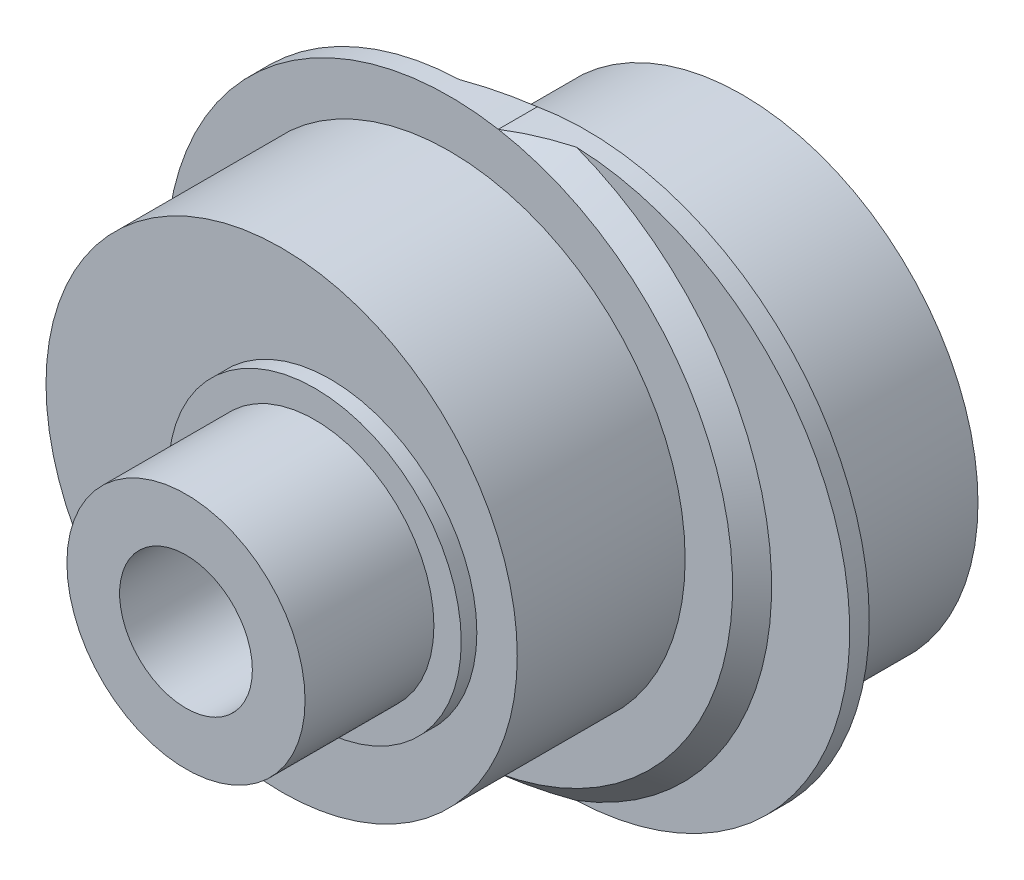
ISO-10303-21;
HEADER;
FILE_DESCRIPTION(('STEP AP214'),'2;1');
FILE_NAME('part.step','',(''),(''),'','','');
FILE_SCHEMA(('AUTOMOTIVE_DESIGN { 1 0 10303 214 1 1 1 1 }'));
ENDSEC;
DATA;
#1=APPLICATION_CONTEXT('core data for automotive mechanical design processes');
#2=APPLICATION_PROTOCOL_DEFINITION('international standard','automotive_design',2000,#1);
#3=PRODUCT_CONTEXT('',#1,'mechanical');
#4=PRODUCT('Part','Part','',(#3));
#5=PRODUCT_RELATED_PRODUCT_CATEGORY('part','',(#4));
#6=PRODUCT_DEFINITION_FORMATION('','',#4);
#7=PRODUCT_DEFINITION_CONTEXT('part definition',#1,'design');
#8=PRODUCT_DEFINITION('design','',#6,#7);
#9=PRODUCT_DEFINITION_SHAPE('','',#8);
#10=(LENGTH_UNIT() NAMED_UNIT(*) SI_UNIT(.MILLI.,.METRE.));
#11=(NAMED_UNIT(*) PLANE_ANGLE_UNIT() SI_UNIT($,.RADIAN.));
#12=(NAMED_UNIT(*) SI_UNIT($,.STERADIAN.) SOLID_ANGLE_UNIT());
#13=UNCERTAINTY_MEASURE_WITH_UNIT(LENGTH_MEASURE(1.E-05),#10,'distance_accuracy_value','');
#14=(GEOMETRIC_REPRESENTATION_CONTEXT(3) GLOBAL_UNCERTAINTY_ASSIGNED_CONTEXT((#13)) GLOBAL_UNIT_ASSIGNED_CONTEXT((#10,
#11,#12)) REPRESENTATION_CONTEXT('',''));
#15=CARTESIAN_POINT('',(0.,0.,0.));
#16=DIRECTION('',(0.,0.,1.));
#17=DIRECTION('',(1.,0.,0.));
#18=AXIS2_PLACEMENT_3D('',#15,#16,#17);
#19=CARTESIAN_POINT('',(1.25,0.,0.));
#20=DIRECTION('',(0.,0.,-1.));
#21=DIRECTION('',(-1.,0.,0.));
#22=AXIS2_PLACEMENT_3D('',#19,#20,#21);
#23=PLANE('',#22);
#24=CARTESIAN_POINT('',(2.55,-2.55,0.));
#25=DIRECTION('',(0.,0.,-1.));
#26=DIRECTION('',(1.,0.,0.));
#27=AXIS2_PLACEMENT_3D('',#24,#25,#26);
#28=CIRCLE('',#27,0.5);
#29=CARTESIAN_POINT('',(3.05,-2.55,0.));
#30=VERTEX_POINT('',#29);
#31=CARTESIAN_POINT('',(2.55,-3.05,0.));
#32=VERTEX_POINT('',#31);
#33=EDGE_CURVE('E67',#30,#32,#28,.T.);
#34=ORIENTED_EDGE('',*,*,#33,.F.);
#35=DIRECTION('',(0.,-1.,0.));
#36=VECTOR('',#35,1.);
#37=CARTESIAN_POINT('',(3.05,2.55,0.));
#38=LINE('',#37,#36);
#39=CARTESIAN_POINT('',(3.05,2.55,0.));
#40=VERTEX_POINT('',#39);
#41=EDGE_CURVE('E166',#40,#30,#38,.T.);
#42=ORIENTED_EDGE('',*,*,#41,.F.);
#43=CARTESIAN_POINT('',(2.55,2.55,0.));
#44=DIRECTION('',(0.,0.,-1.));
#45=DIRECTION('',(1.,0.,0.));
#46=AXIS2_PLACEMENT_3D('',#43,#44,#45);
#47=CIRCLE('',#46,0.5);
#48=CARTESIAN_POINT('',(2.55,3.05,0.));
#49=VERTEX_POINT('',#48);
#50=EDGE_CURVE('E170',#49,#40,#47,.T.);
#51=ORIENTED_EDGE('',*,*,#50,.F.);
#52=DIRECTION('',(1.,0.,0.));
#53=VECTOR('',#52,1.);
#54=CARTESIAN_POINT('',(2.55,3.05,0.));
#55=LINE('',#54,#53);
#56=CARTESIAN_POINT('',(-2.55,3.05,0.));
#57=VERTEX_POINT('',#56);
#58=EDGE_CURVE('E209',#57,#49,#55,.T.);
#59=ORIENTED_EDGE('',*,*,#58,.F.);
#60=CARTESIAN_POINT('',(-2.55,2.55,0.));
#61=DIRECTION('',(0.,0.,-1.));
#62=DIRECTION('',(-1.,0.,0.));
#63=AXIS2_PLACEMENT_3D('',#60,#61,#62);
#64=CIRCLE('',#63,0.5);
#65=CARTESIAN_POINT('',(-3.05,2.55,0.));
#66=VERTEX_POINT('',#65);
#67=EDGE_CURVE('E205',#66,#57,#64,.T.);
#68=ORIENTED_EDGE('',*,*,#67,.F.);
#69=DIRECTION('',(0.,1.,0.));
#70=VECTOR('',#69,1.);
#71=CARTESIAN_POINT('',(-3.05,2.55,0.));
#72=LINE('',#71,#70);
#73=CARTESIAN_POINT('',(-3.05,-2.55,0.));
#74=VERTEX_POINT('',#73);
#75=EDGE_CURVE('E201',#74,#66,#72,.T.);
#76=ORIENTED_EDGE('',*,*,#75,.F.);
#77=CARTESIAN_POINT('',(-2.55,-2.55,0.));
#78=DIRECTION('',(0.,0.,-1.));
#79=DIRECTION('',(-1.,0.,0.));
#80=AXIS2_PLACEMENT_3D('',#77,#78,#79);
#81=CIRCLE('',#80,0.5);
#82=CARTESIAN_POINT('',(-2.55,-3.05,0.));
#83=VERTEX_POINT('',#82);
#84=EDGE_CURVE('E197',#83,#74,#81,.T.);
#85=ORIENTED_EDGE('',*,*,#84,.F.);
#86=DIRECTION('',(-1.,0.,0.));
#87=VECTOR('',#86,1.);
#88=CARTESIAN_POINT('',(2.55,-3.05,0.));
#89=LINE('',#88,#87);
#90=EDGE_CURVE('E194',#32,#83,#89,.T.);
#91=ORIENTED_EDGE('',*,*,#90,.F.);
#92=EDGE_LOOP('',(#34,#42,#51,#59,#68,#76,#85,#91));
#93=FACE_BOUND('',#92,.T.);
#94=CARTESIAN_POINT('',(1.25,0.,0.));
#95=DIRECTION('',(0.,0.,-1.));
#96=DIRECTION('',(-1.,0.,0.));
#97=AXIS2_PLACEMENT_3D('',#94,#95,#96);
#98=CIRCLE('',#97,6.035);
#99=CARTESIAN_POINT('',(-4.785,0.,0.));
#100=VERTEX_POINT('',#99);
#101=EDGE_CURVE('E252',#100,#100,#98,.T.);
#102=ORIENTED_EDGE('',*,*,#101,.T.);
#103=EDGE_LOOP('',(#102));
#104=FACE_BOUND('',#103,.T.);
#105=ADVANCED_FACE('F50',(#93,#104),#23,.T.);
#106=CARTESIAN_POINT('',(0.,0.,5.));
#107=DIRECTION('',(0.,0.,1.));
#108=DIRECTION('',(1.,0.,0.));
#109=AXIS2_PLACEMENT_3D('',#106,#107,#108);
#110=PLANE('',#109);
#111=CARTESIAN_POINT('',(-1.25,0.,5.));
#112=DIRECTION('',(0.,0.,1.));
#113=DIRECTION('',(1.,0.,0.));
#114=AXIS2_PLACEMENT_3D('',#111,#112,#113);
#115=CIRCLE('',#114,6.035);
#116=CARTESIAN_POINT('',(4.785,0.,5.));
#117=VERTEX_POINT('',#116);
#118=EDGE_CURVE('E256',#117,#117,#115,.T.);
#119=ORIENTED_EDGE('',*,*,#118,.F.);
#120=EDGE_LOOP('',(#119));
#121=FACE_BOUND('',#120,.T.);
#122=CARTESIAN_POINT('',(-1.25,0.,5.));
#123=DIRECTION('',(0.,0.,1.));
#124=DIRECTION('',(1.,0.,0.));
#125=AXIS2_PLACEMENT_3D('',#122,#123,#124);
#126=CIRCLE('',#125,7.25);
#127=CARTESIAN_POINT('',(0.,-7.14142842854285,5.));
#128=VERTEX_POINT('',#127);
#129=CARTESIAN_POINT('',(0.,7.14142842854285,5.));
#130=VERTEX_POINT('',#129);
#131=EDGE_CURVE('E74',#128,#130,#126,.F.);
#132=ORIENTED_EDGE('',*,*,#131,.F.);
#133=EDGE_CURVE('E476',#130,#128,#126,.F.);
#134=ORIENTED_EDGE('',*,*,#133,.F.);
#135=EDGE_LOOP('',(#132,#134));
#136=FACE_BOUND('',#135,.T.);
#137=ADVANCED_FACE('F52',(#121,#136),#110,.T.);
#138=CARTESIAN_POINT('',(1.25,0.,5.002));
#139=DIRECTION('',(0.,0.,-1.));
#140=DIRECTION('',(-1.,0.,0.));
#141=AXIS2_PLACEMENT_3D('',#138,#139,#140);
#142=CYLINDRICAL_SURFACE('',#141,7.25);
#143=DIRECTION('',(0.,0.,-1.));
#144=VECTOR('',#143,1.);
#145=CARTESIAN_POINT('',(0.,-7.14142842854286,4.5));
#146=LINE('',#145,#144);
#147=CARTESIAN_POINT('',(0.,-7.14142842854285,4.));
#148=VERTEX_POINT('',#147);
#149=EDGE_CURVE('E403',#148,#128,#146,.F.);
#150=ORIENTED_EDGE('',*,*,#149,.F.);
#151=CARTESIAN_POINT('',(1.25,0.,4.));
#152=DIRECTION('',(0.,0.,1.));
#153=DIRECTION('',(1.,0.,0.));
#154=AXIS2_PLACEMENT_3D('',#151,#152,#153);
#155=CIRCLE('',#154,7.25);
#156=CARTESIAN_POINT('',(0.,7.14142842854285,4.));
#157=VERTEX_POINT('',#156);
#158=EDGE_CURVE('E401',#148,#157,#155,.T.);
#159=ORIENTED_EDGE('',*,*,#158,.T.);
#160=DIRECTION('',(0.,0.,-1.));
#161=VECTOR('',#160,1.);
#162=CARTESIAN_POINT('',(0.,7.14142842854285,5.));
#163=LINE('',#162,#161);
#164=EDGE_CURVE('E402',#130,#157,#163,.T.);
#165=ORIENTED_EDGE('',*,*,#164,.F.);
#166=CARTESIAN_POINT('',(0.,7.14142842854285,5.));
#167=CARTESIAN_POINT('',(0.123509212670828,7.16304891105433,4.95740968363325));
#168=CARTESIAN_POINT('',(0.247635722677284,7.18147105171403,4.91498366677334));
#169=CARTESIAN_POINT('',(0.49651091045968,7.21182527272824,4.83064523991889));
#170=CARTESIAN_POINT('',(0.621257332919159,7.22377306991179,4.78873182975381));
#171=CARTESIAN_POINT('',(0.871367149572558,7.24119131188943,4.7053944927514));
#172=CARTESIAN_POINT('',(0.996730552877659,7.24666166073876,4.66397057317345));
#173=CARTESIAN_POINT('',(1.24806465393637,7.25109232554975,4.58158902108588));
#174=CARTESIAN_POINT('',(1.37403608710189,7.25003669470633,4.54063277598186));
#175=CARTESIAN_POINT('',(1.5,7.24568837309472,4.5));
#176=B_SPLINE_CURVE_WITH_KNOTS('',3,(#166,#167,#168,#169,#170,#171,#172,#173,#174,#175),
.UNSPECIFIED.,.F.,.F.,(4,2,2,2,4),(0.,0.397230594114684,0.793492519067464,1.18976031342777,
1.58699680509372),.UNSPECIFIED.);
#177=CARTESIAN_POINT('',(1.5,7.24568837309472,4.5));
#178=VERTEX_POINT('',#177);
#179=EDGE_CURVE('E313',#130,#178,#176,.T.);
#180=ORIENTED_EDGE('',*,*,#179,.T.);
#181=CARTESIAN_POINT('',(1.25,0.,4.5));
#182=DIRECTION('',(0.,0.,1.));
#183=DIRECTION('',(1.,0.,0.));
#184=AXIS2_PLACEMENT_3D('',#181,#182,#183);
#185=CIRCLE('',#184,7.25);
#186=CARTESIAN_POINT('',(1.5,-7.24568837309472,4.5));
#187=VERTEX_POINT('',#186);
#188=EDGE_CURVE('E328',#187,#178,#185,.T.);
#189=ORIENTED_EDGE('',*,*,#188,.F.);
#190=CARTESIAN_POINT('',(1.5,-7.24568837309472,4.5));
#191=CARTESIAN_POINT('',(1.37403608710189,-7.25003669470633,4.54063277598186));
#192=CARTESIAN_POINT('',(1.24806465393637,-7.25109232554975,4.58158902108588));
#193=CARTESIAN_POINT('',(0.996730552877659,-7.24666166073876,4.66397057317345));
#194=CARTESIAN_POINT('',(0.871367149572559,-7.24119131188943,4.7053944927514));
#195=CARTESIAN_POINT('',(0.621257332919159,-7.22377306991179,4.78873182975381));
#196=CARTESIAN_POINT('',(0.49651091045968,-7.21182527272824,4.83064523991889));
#197=CARTESIAN_POINT('',(0.247635722677285,-7.18147105171403,4.91498366677334));
#198=CARTESIAN_POINT('',(0.123509212670829,-7.16304891105433,4.95740968363325));
#199=CARTESIAN_POINT('',(0.,-7.14142842854285,5.));
#200=B_SPLINE_CURVE_WITH_KNOTS('',3,(#190,#191,#192,#193,#194,#195,#196,#197,#198,#199),
.UNSPECIFIED.,.F.,.F.,(4,2,2,2,4),(0.,0.397236491665957,0.793504286026259,1.18976621097904,
1.58699680509372),.UNSPECIFIED.);
#201=EDGE_CURVE('E322',#187,#128,#200,.T.);
#202=ORIENTED_EDGE('',*,*,#201,.T.);
#203=EDGE_LOOP('',(#150,#159,#165,#180,#189,#202));
#204=FACE_BOUND('',#203,.T.);
#205=ADVANCED_FACE('F303',(#204),#142,.T.);
#206=CARTESIAN_POINT('',(0.,0.,4.));
#207=DIRECTION('',(0.,0.,1.));
#208=DIRECTION('',(1.,0.,0.));
#209=AXIS2_PLACEMENT_3D('',#206,#207,#208);
#210=PLANE('',#209);
#211=CARTESIAN_POINT('',(1.25,0.,4.));
#212=DIRECTION('',(0.,0.,1.));
#213=DIRECTION('',(1.,0.,0.));
#214=AXIS2_PLACEMENT_3D('',#211,#212,#213);
#215=CIRCLE('',#214,6.035);
#216=CARTESIAN_POINT('',(7.285,0.,4.));
#217=VERTEX_POINT('',#216);
#218=EDGE_CURVE('E60',#217,#217,#215,.F.);
#219=ORIENTED_EDGE('',*,*,#218,.F.);
#220=EDGE_LOOP('',(#219));
#221=FACE_BOUND('',#220,.T.);
#222=EDGE_CURVE('E329',#157,#148,#155,.T.);
#223=ORIENTED_EDGE('',*,*,#222,.F.);
#224=ORIENTED_EDGE('',*,*,#158,.F.);
#225=EDGE_LOOP('',(#223,#224));
#226=FACE_BOUND('',#225,.T.);
#227=ADVANCED_FACE('F298',(#221,#226),#210,.F.);
#228=CARTESIAN_POINT('',(-1.25,0.,5.002));
#229=DIRECTION('',(0.,0.,-1.));
#230=DIRECTION('',(-1.,0.,0.));
#231=AXIS2_PLACEMENT_3D('',#228,#229,#230);
#232=CYLINDRICAL_SURFACE('',#231,7.25);
#233=CARTESIAN_POINT('',(-1.25,0.,4.5));
#234=DIRECTION('',(0.,0.,-1.));
#235=DIRECTION('',(1.,0.,0.));
#236=AXIS2_PLACEMENT_3D('',#233,#234,#235);
#237=CIRCLE('',#236,7.25);
#238=CARTESIAN_POINT('',(-1.49999999999996,-7.24568837309473,4.5));
#239=VERTEX_POINT('',#238);
#240=CARTESIAN_POINT('',(-1.50000000000003,7.24568837309471,4.5));
#241=VERTEX_POINT('',#240);
#242=EDGE_CURVE('E330',#239,#241,#237,.T.);
#243=ORIENTED_EDGE('',*,*,#242,.F.);
#244=CARTESIAN_POINT('',(-1.49999999999996,-7.24568837309473,4.5));
#245=CARTESIAN_POINT('',(-1.37403608710186,-7.25003669470634,4.45936722401813));
#246=CARTESIAN_POINT('',(-1.24806465393634,-7.25109232554975,4.41841097891411));
#247=CARTESIAN_POINT('',(-0.996730552877636,-7.24666166073876,4.33602942682654));
#248=CARTESIAN_POINT('',(-0.871367149572538,-7.24119131188943,4.2946055072486));
#249=CARTESIAN_POINT('',(-0.621257332919143,-7.22377306991179,4.21126817024618));
#250=CARTESIAN_POINT('',(-0.496510910459668,-7.21182527272824,4.1693547600811));
#251=CARTESIAN_POINT('',(-0.247635722677277,-7.18147105171403,4.08501633322665));
#252=CARTESIAN_POINT('',(-0.123509212670824,-7.16304891105433,4.04259031636675));
#253=CARTESIAN_POINT('',(0.,-7.14142842854285,4.));
#254=B_SPLINE_CURVE_WITH_KNOTS('',3,(#244,#245,#246,#247,#248,#249,#250,#251,#252,#253),
.UNSPECIFIED.,.F.,.F.,(4,2,2,2,4),(0.,0.397236491665947,0.793504286026242,1.18976621097901,
1.58699680509369),.UNSPECIFIED.);
#255=EDGE_CURVE('E282',#239,#148,#254,.T.);
#256=ORIENTED_EDGE('',*,*,#255,.T.);
#257=ORIENTED_EDGE('',*,*,#149,.T.);
#258=ORIENTED_EDGE('',*,*,#131,.T.);
#259=ORIENTED_EDGE('',*,*,#164,.T.);
#260=CARTESIAN_POINT('',(0.,7.14142842854285,4.));
#261=CARTESIAN_POINT('',(-0.123509212670831,7.16304891105433,4.04259031636675));
#262=CARTESIAN_POINT('',(-0.24763572267729,7.18147105171404,4.08501633322666));
#263=CARTESIAN_POINT('',(-0.49651091045969,7.21182527272825,4.16935476008111));
#264=CARTESIAN_POINT('',(-0.62125733291917,7.22377306991179,4.21126817024619));
#265=CARTESIAN_POINT('',(-0.871367149572574,7.24119131188943,4.29460550724861));
#266=CARTESIAN_POINT('',(-0.996730552877677,7.24666166073876,4.33602942682656));
#267=CARTESIAN_POINT('',(-1.24806465393639,7.25109232554975,4.41841097891412));
#268=CARTESIAN_POINT('',(-1.37403608710192,7.25003669470633,4.45936722401814));
#269=CARTESIAN_POINT('',(-1.50000000000003,7.24568837309472,4.5));
#270=B_SPLINE_CURVE_WITH_KNOTS('',3,(#260,#261,#262,#263,#264,#265,#266,#267,#268,#269),
.UNSPECIFIED.,.F.,.F.,(4,2,2,2,4),(0.,0.397230594114692,0.793492519067479,1.18976031342779,
1.58699680509375),.UNSPECIFIED.);
#271=EDGE_CURVE('E272',#157,#241,#270,.T.);
#272=ORIENTED_EDGE('',*,*,#271,.T.);
#273=EDGE_LOOP('',(#243,#256,#257,#258,#259,#272));
#274=FACE_BOUND('',#273,.T.);
#275=ADVANCED_FACE('F293',(#274),#232,.T.);
#276=CARTESIAN_POINT('',(0.,0.,4.5));
#277=DIRECTION('',(0.,0.,1.));
#278=DIRECTION('',(1.,0.,0.));
#279=AXIS2_PLACEMENT_3D('',#276,#277,#278);
#280=PLANE('',#279);
#281=ORIENTED_EDGE('',*,*,#188,.T.);
#282=CARTESIAN_POINT('',(-1.25,0.,4.5));
#283=DIRECTION('',(0.,0.,1.));
#284=DIRECTION('',(1.,0.,0.));
#285=AXIS2_PLACEMENT_3D('',#282,#283,#284);
#286=CIRCLE('',#285,7.75);
#287=EDGE_CURVE('E268',#178,#187,#286,.F.);
#288=ORIENTED_EDGE('',*,*,#287,.T.);
#289=EDGE_LOOP('',(#281,#288));
#290=FACE_BOUND('',#289,.T.);
#291=ADVANCED_FACE('F297',(#290),#280,.T.);
#292=CARTESIAN_POINT('',(0.,0.,4.5));
#293=DIRECTION('',(0.,0.,1.));
#294=DIRECTION('',(1.,0.,0.));
#295=AXIS2_PLACEMENT_3D('',#292,#293,#294);
#296=PLANE('',#295);
#297=ORIENTED_EDGE('',*,*,#242,.T.);
#298=CARTESIAN_POINT('',(1.25,0.,4.5));
#299=DIRECTION('',(0.,0.,1.));
#300=DIRECTION('',(1.,0.,0.));
#301=AXIS2_PLACEMENT_3D('',#298,#299,#300);
#302=CIRCLE('',#301,7.75);
#303=EDGE_CURVE('E261',#241,#239,#302,.T.);
#304=ORIENTED_EDGE('',*,*,#303,.T.);
#305=EDGE_LOOP('',(#297,#304));
#306=FACE_BOUND('',#305,.T.);
#307=ADVANCED_FACE('F308',(#306),#296,.F.);
#308=CARTESIAN_POINT('',(-1.25,0.,4.5));
#309=DIRECTION('',(0.,0.,-1.));
#310=DIRECTION('',(-1.,0.,0.));
#311=AXIS2_PLACEMENT_3D('',#308,#309,#310);
#312=CONICAL_SURFACE('',#311,7.75,0.785398163397448);
#313=ORIENTED_EDGE('',*,*,#179,.F.);
#314=ORIENTED_EDGE('',*,*,#133,.T.);
#315=ORIENTED_EDGE('',*,*,#201,.F.);
#316=ORIENTED_EDGE('',*,*,#287,.F.);
#317=EDGE_LOOP('',(#313,#314,#315,#316));
#318=FACE_BOUND('',#317,.T.);
#319=ADVANCED_FACE('F305',(#318),#312,.T.);
#320=CARTESIAN_POINT('',(1.25,0.,4.5));
#321=DIRECTION('',(0.,0.,1.));
#322=DIRECTION('',(1.,0.,0.));
#323=AXIS2_PLACEMENT_3D('',#320,#321,#322);
#324=CONICAL_SURFACE('',#323,7.75,0.785398163397448);
#325=ORIENTED_EDGE('',*,*,#271,.F.);
#326=ORIENTED_EDGE('',*,*,#222,.T.);
#327=ORIENTED_EDGE('',*,*,#255,.F.);
#328=ORIENTED_EDGE('',*,*,#303,.F.);
#329=EDGE_LOOP('',(#325,#326,#327,#328));
#330=FACE_BOUND('',#329,.T.);
#331=ADVANCED_FACE('F290',(#330),#324,.T.);
#332=CARTESIAN_POINT('',(-1.25,0.,9.3));
#333=DIRECTION('',(0.,0.,-1.));
#334=DIRECTION('',(-1.,0.,0.));
#335=AXIS2_PLACEMENT_3D('',#332,#333,#334);
#336=CYLINDRICAL_SURFACE('',#335,6.035);
#337=CARTESIAN_POINT('',(-1.25,0.,9.3));
#338=DIRECTION('',(0.,0.,1.));
#339=DIRECTION('',(1.,0.,0.));
#340=AXIS2_PLACEMENT_3D('',#337,#338,#339);
#341=CIRCLE('',#340,6.035);
#342=CARTESIAN_POINT('',(4.785,0.,9.3));
#343=VERTEX_POINT('',#342);
#344=EDGE_CURVE('E257',#343,#343,#341,.T.);
#345=ORIENTED_EDGE('',*,*,#344,.F.);
#346=EDGE_LOOP('',(#345));
#347=FACE_BOUND('',#346,.T.);
#348=ORIENTED_EDGE('',*,*,#118,.T.);
#349=EDGE_LOOP('',(#348));
#350=FACE_BOUND('',#349,.T.);
#351=ADVANCED_FACE('F555',(#347,#350),#336,.T.);
#352=CARTESIAN_POINT('',(-1.25,0.,9.3));
#353=DIRECTION('',(0.,0.,1.));
#354=DIRECTION('',(1.,0.,0.));
#355=AXIS2_PLACEMENT_3D('',#352,#353,#354);
#356=PLANE('',#355);
#357=CARTESIAN_POINT('',(0.,0.,9.3));
#358=DIRECTION('',(0.,0.,1.));
#359=DIRECTION('',(1.,0.,0.));
#360=AXIS2_PLACEMENT_3D('',#357,#358,#359);
#361=CIRCLE('',#360,3.75);
#362=CARTESIAN_POINT('',(3.75,0.,9.3));
#363=VERTEX_POINT('',#362);
#364=EDGE_CURVE('E12',#363,#363,#361,.T.);
#365=ORIENTED_EDGE('',*,*,#364,.F.);
#366=EDGE_LOOP('',(#365));
#367=FACE_BOUND('',#366,.T.);
#368=ORIENTED_EDGE('',*,*,#344,.T.);
#369=EDGE_LOOP('',(#368));
#370=FACE_BOUND('',#369,.T.);
#371=ADVANCED_FACE('F551',(#367,#370),#356,.T.);
#372=CARTESIAN_POINT('',(1.25,0.,0.));
#373=DIRECTION('',(0.,0.,1.));
#374=DIRECTION('',(1.,0.,0.));
#375=AXIS2_PLACEMENT_3D('',#372,#373,#374);
#376=CYLINDRICAL_SURFACE('',#375,6.035);
#377=ORIENTED_EDGE('',*,*,#101,.F.);
#378=EDGE_LOOP('',(#377));
#379=FACE_BOUND('',#378,.T.);
#380=ORIENTED_EDGE('',*,*,#218,.T.);
#381=EDGE_LOOP('',(#380));
#382=FACE_BOUND('',#381,.T.);
#383=ADVANCED_FACE('F548',(#379,#382),#376,.T.);
#384=CARTESIAN_POINT('',(0.,0.,13.));
#385=DIRECTION('',(0.,0.,-1.));
#386=DIRECTION('',(-1.,0.,0.));
#387=AXIS2_PLACEMENT_3D('',#384,#385,#386);
#388=CYLINDRICAL_SURFACE('',#387,3.05);
#389=CARTESIAN_POINT('',(0.,0.,13.));
#390=DIRECTION('',(0.,0.,-1.));
#391=DIRECTION('',(-1.,0.,0.));
#392=AXIS2_PLACEMENT_3D('',#389,#390,#391);
#393=CIRCLE('',#392,3.05);
#394=CARTESIAN_POINT('',(-3.05,0.,13.));
#395=VERTEX_POINT('',#394);
#396=EDGE_CURVE('E248',#395,#395,#393,.T.);
#397=ORIENTED_EDGE('',*,*,#396,.T.);
#398=EDGE_LOOP('',(#397));
#399=FACE_BOUND('',#398,.T.);
#400=CARTESIAN_POINT('',(0.,0.,9.7));
#401=DIRECTION('',(0.,0.,-1.));
#402=DIRECTION('',(-1.,0.,0.));
#403=AXIS2_PLACEMENT_3D('',#400,#401,#402);
#404=CIRCLE('',#403,3.05);
#405=CARTESIAN_POINT('',(-3.05,0.,9.7));
#406=VERTEX_POINT('',#405);
#407=EDGE_CURVE('E240',#406,#406,#404,.T.);
#408=ORIENTED_EDGE('',*,*,#407,.F.);
#409=EDGE_LOOP('',(#408));
#410=FACE_BOUND('',#409,.T.);
#411=ADVANCED_FACE('F546',(#399,#410),#388,.T.);
#412=CARTESIAN_POINT('',(3.05,0.,13.));
#413=DIRECTION('',(0.,0.,1.));
#414=DIRECTION('',(1.,0.,0.));
#415=AXIS2_PLACEMENT_3D('',#412,#413,#414);
#416=PLANE('',#415);
#417=CARTESIAN_POINT('',(0.,0.,13.));
#418=DIRECTION('',(0.,0.,1.));
#419=DIRECTION('',(1.,0.,0.));
#420=AXIS2_PLACEMENT_3D('',#417,#418,#419);
#421=CIRCLE('',#420,1.69999999999999);
#422=CARTESIAN_POINT('',(1.69999999999999,0.,13.));
#423=VERTEX_POINT('',#422);
#424=EDGE_CURVE('E236',#423,#423,#421,.T.);
#425=ORIENTED_EDGE('',*,*,#424,.F.);
#426=EDGE_LOOP('',(#425));
#427=FACE_BOUND('',#426,.T.);
#428=ORIENTED_EDGE('',*,*,#396,.F.);
#429=EDGE_LOOP('',(#428));
#430=FACE_BOUND('',#429,.T.);
#431=ADVANCED_FACE('F601',(#427,#430),#416,.T.);
#432=CARTESIAN_POINT('',(0.,0.,13.));
#433=DIRECTION('',(0.,0.,-1.));
#434=DIRECTION('',(-1.,0.,0.));
#435=AXIS2_PLACEMENT_3D('',#432,#433,#434);
#436=CYLINDRICAL_SURFACE('',#435,3.75);
#437=ORIENTED_EDGE('',*,*,#364,.T.);
#438=EDGE_LOOP('',(#437));
#439=FACE_BOUND('',#438,.T.);
#440=CARTESIAN_POINT('',(0.,0.,9.7));
#441=DIRECTION('',(0.,0.,-1.));
#442=DIRECTION('',(-1.,0.,0.));
#443=AXIS2_PLACEMENT_3D('',#440,#441,#442);
#444=CIRCLE('',#443,3.75);
#445=CARTESIAN_POINT('',(-3.75,0.,9.7));
#446=VERTEX_POINT('',#445);
#447=EDGE_CURVE('E244',#446,#446,#444,.T.);
#448=ORIENTED_EDGE('',*,*,#447,.T.);
#449=EDGE_LOOP('',(#448));
#450=FACE_BOUND('',#449,.T.);
#451=ADVANCED_FACE('F609',(#439,#450),#436,.T.);
#452=CARTESIAN_POINT('',(3.75,0.,9.7));
#453=DIRECTION('',(0.,0.,1.));
#454=DIRECTION('',(1.,0.,0.));
#455=AXIS2_PLACEMENT_3D('',#452,#453,#454);
#456=PLANE('',#455);
#457=ORIENTED_EDGE('',*,*,#407,.T.);
#458=EDGE_LOOP('',(#457));
#459=FACE_BOUND('',#458,.T.);
#460=ORIENTED_EDGE('',*,*,#447,.F.);
#461=EDGE_LOOP('',(#460));
#462=FACE_BOUND('',#461,.T.);
#463=ADVANCED_FACE('F533',(#459,#462),#456,.T.);
#464=CARTESIAN_POINT('',(0.,0.,13.));
#465=DIRECTION('',(0.,0.,1.));
#466=DIRECTION('',(1.,0.,0.));
#467=AXIS2_PLACEMENT_3D('',#464,#465,#466);
#468=CYLINDRICAL_SURFACE('',#467,1.69999999999999);
#469=CARTESIAN_POINT('',(0.,0.,8.5));
#470=DIRECTION('',(0.,0.,1.));
#471=DIRECTION('',(1.,0.,0.));
#472=AXIS2_PLACEMENT_3D('',#469,#470,#471);
#473=CIRCLE('',#472,1.69999999999999);
#474=CARTESIAN_POINT('',(1.69999999999999,0.,8.5));
#475=VERTEX_POINT('',#474);
#476=EDGE_CURVE('E54',#475,#475,#473,.F.);
#477=ORIENTED_EDGE('',*,*,#476,.T.);
#478=EDGE_LOOP('',(#477));
#479=FACE_BOUND('',#478,.T.);
#480=ORIENTED_EDGE('',*,*,#424,.T.);
#481=EDGE_LOOP('',(#480));
#482=FACE_BOUND('',#481,.T.);
#483=ADVANCED_FACE('F523',(#479,#482),#468,.F.);
#484=CARTESIAN_POINT('',(2.55,-2.55,8.5));
#485=DIRECTION('',(0.,0.,1.));
#486=DIRECTION('',(1.,0.,0.));
#487=AXIS2_PLACEMENT_3D('',#484,#485,#486);
#488=PLANE('',#487);
#489=CARTESIAN_POINT('',(2.55,-2.55,8.5));
#490=DIRECTION('',(0.,0.,-1.));
#491=DIRECTION('',(1.,0.,0.));
#492=AXIS2_PLACEMENT_3D('',#489,#490,#491);
#493=CIRCLE('',#492,0.5);
#494=CARTESIAN_POINT('',(3.05,-2.55,8.5));
#495=VERTEX_POINT('',#494);
#496=CARTESIAN_POINT('',(2.55,-3.05,8.5));
#497=VERTEX_POINT('',#496);
#498=EDGE_CURVE('E143',#495,#497,#493,.T.);
#499=ORIENTED_EDGE('',*,*,#498,.T.);
#500=DIRECTION('',(-1.,0.,0.));
#501=VECTOR('',#500,1.);
#502=CARTESIAN_POINT('',(2.55,-3.05,8.5));
#503=LINE('',#502,#501);
#504=CARTESIAN_POINT('',(-2.55,-3.05,8.5));
#505=VERTEX_POINT('',#504);
#506=EDGE_CURVE('E153',#497,#505,#503,.T.);
#507=ORIENTED_EDGE('',*,*,#506,.T.);
#508=CARTESIAN_POINT('',(-2.55,-2.55,8.5));
#509=DIRECTION('',(0.,0.,-1.));
#510=DIRECTION('',(-1.,0.,0.));
#511=AXIS2_PLACEMENT_3D('',#508,#509,#510);
#512=CIRCLE('',#511,0.5);
#513=CARTESIAN_POINT('',(-3.05,-2.55,8.5));
#514=VERTEX_POINT('',#513);
#515=EDGE_CURVE('E159',#505,#514,#512,.T.);
#516=ORIENTED_EDGE('',*,*,#515,.T.);
#517=DIRECTION('',(0.,1.,0.));
#518=VECTOR('',#517,1.);
#519=CARTESIAN_POINT('',(-3.05,2.55,8.5));
#520=LINE('',#519,#518);
#521=CARTESIAN_POINT('',(-3.05,2.55,8.5));
#522=VERTEX_POINT('',#521);
#523=EDGE_CURVE('E175',#514,#522,#520,.T.);
#524=ORIENTED_EDGE('',*,*,#523,.T.);
#525=CARTESIAN_POINT('',(-2.55,2.55,8.5));
#526=DIRECTION('',(0.,0.,-1.));
#527=DIRECTION('',(-1.,0.,0.));
#528=AXIS2_PLACEMENT_3D('',#525,#526,#527);
#529=CIRCLE('',#528,0.5);
#530=CARTESIAN_POINT('',(-2.55,3.05,8.5));
#531=VERTEX_POINT('',#530);
#532=EDGE_CURVE('E179',#522,#531,#529,.T.);
#533=ORIENTED_EDGE('',*,*,#532,.T.);
#534=DIRECTION('',(1.,0.,0.));
#535=VECTOR('',#534,1.);
#536=CARTESIAN_POINT('',(2.55,3.05,8.5));
#537=LINE('',#536,#535);
#538=CARTESIAN_POINT('',(2.55,3.05,8.5));
#539=VERTEX_POINT('',#538);
#540=EDGE_CURVE('E183',#531,#539,#537,.T.);
#541=ORIENTED_EDGE('',*,*,#540,.T.);
#542=CARTESIAN_POINT('',(2.55,2.55,8.5));
#543=DIRECTION('',(0.,0.,-1.));
#544=DIRECTION('',(1.,0.,0.));
#545=AXIS2_PLACEMENT_3D('',#542,#543,#544);
#546=CIRCLE('',#545,0.5);
#547=CARTESIAN_POINT('',(3.05,2.55,8.5));
#548=VERTEX_POINT('',#547);
#549=EDGE_CURVE('E187',#539,#548,#546,.T.);
#550=ORIENTED_EDGE('',*,*,#549,.T.);
#551=DIRECTION('',(0.,-1.,0.));
#552=VECTOR('',#551,1.);
#553=CARTESIAN_POINT('',(3.05,2.55,8.5));
#554=LINE('',#553,#552);
#555=EDGE_CURVE('E150',#548,#495,#554,.T.);
#556=ORIENTED_EDGE('',*,*,#555,.T.);
#557=EDGE_LOOP('',(#499,#507,#516,#524,#533,#541,#550,#556));
#558=FACE_BOUND('',#557,.T.);
#559=ORIENTED_EDGE('',*,*,#476,.F.);
#560=EDGE_LOOP('',(#559));
#561=FACE_BOUND('',#560,.T.);
#562=ADVANCED_FACE('F161',(#558,#561),#488,.F.);
#563=CARTESIAN_POINT('',(2.55,-2.55,8.5));
#564=DIRECTION('',(0.,0.,-1.));
#565=DIRECTION('',(-1.,0.,0.));
#566=AXIS2_PLACEMENT_3D('',#563,#564,#565);
#567=CYLINDRICAL_SURFACE('',#566,0.5);
#568=ORIENTED_EDGE('',*,*,#33,.T.);
#569=DIRECTION('',(0.,0.,-1.));
#570=VECTOR('',#569,1.);
#571=CARTESIAN_POINT('',(2.55,-3.05,8.5));
#572=LINE('',#571,#570);
#573=EDGE_CURVE('E139',#497,#32,#572,.T.);
#574=ORIENTED_EDGE('',*,*,#573,.F.);
#575=ORIENTED_EDGE('',*,*,#498,.F.);
#576=DIRECTION('',(0.,0.,-1.));
#577=VECTOR('',#576,1.);
#578=CARTESIAN_POINT('',(3.05,-2.55,8.5));
#579=LINE('',#578,#577);
#580=EDGE_CURVE('E216',#495,#30,#579,.T.);
#581=ORIENTED_EDGE('',*,*,#580,.T.);
#582=EDGE_LOOP('',(#568,#574,#575,#581));
#583=FACE_BOUND('',#582,.T.);
#584=ADVANCED_FACE('F141',(#583),#567,.F.);
#585=CARTESIAN_POINT('',(3.05,2.55,8.5));
#586=DIRECTION('',(1.,0.,0.));
#587=DIRECTION('',(0.,1.,0.));
#588=AXIS2_PLACEMENT_3D('',#585,#586,#587);
#589=PLANE('',#588);
#590=ORIENTED_EDGE('',*,*,#41,.T.);
#591=ORIENTED_EDGE('',*,*,#580,.F.);
#592=ORIENTED_EDGE('',*,*,#555,.F.);
#593=DIRECTION('',(0.,0.,-1.));
#594=VECTOR('',#593,1.);
#595=CARTESIAN_POINT('',(3.05,2.55,8.5));
#596=LINE('',#595,#594);
#597=EDGE_CURVE('E219',#548,#40,#596,.T.);
#598=ORIENTED_EDGE('',*,*,#597,.T.);
#599=EDGE_LOOP('',(#590,#591,#592,#598));
#600=FACE_BOUND('',#599,.T.);
#601=ADVANCED_FACE('F531',(#600),#589,.F.);
#602=CARTESIAN_POINT('',(2.55,2.55,8.5));
#603=DIRECTION('',(0.,0.,-1.));
#604=DIRECTION('',(-1.,0.,0.));
#605=AXIS2_PLACEMENT_3D('',#602,#603,#604);
#606=CYLINDRICAL_SURFACE('',#605,0.5);
#607=ORIENTED_EDGE('',*,*,#50,.T.);
#608=ORIENTED_EDGE('',*,*,#597,.F.);
#609=ORIENTED_EDGE('',*,*,#549,.F.);
#610=DIRECTION('',(0.,0.,-1.));
#611=VECTOR('',#610,1.);
#612=CARTESIAN_POINT('',(2.55,3.05,8.5));
#613=LINE('',#612,#611);
#614=EDGE_CURVE('E222',#539,#49,#613,.T.);
#615=ORIENTED_EDGE('',*,*,#614,.T.);
#616=EDGE_LOOP('',(#607,#608,#609,#615));
#617=FACE_BOUND('',#616,.T.);
#618=ADVANCED_FACE('F652',(#617),#606,.F.);
#619=CARTESIAN_POINT('',(2.55,3.05,8.5));
#620=DIRECTION('',(0.,1.,0.));
#621=DIRECTION('',(0.,0.,1.));
#622=AXIS2_PLACEMENT_3D('',#619,#620,#621);
#623=PLANE('',#622);
#624=ORIENTED_EDGE('',*,*,#58,.T.);
#625=ORIENTED_EDGE('',*,*,#614,.F.);
#626=ORIENTED_EDGE('',*,*,#540,.F.);
#627=DIRECTION('',(0.,0.,-1.));
#628=VECTOR('',#627,1.);
#629=CARTESIAN_POINT('',(-2.55,3.05,8.5));
#630=LINE('',#629,#628);
#631=EDGE_CURVE('E225',#531,#57,#630,.T.);
#632=ORIENTED_EDGE('',*,*,#631,.T.);
#633=EDGE_LOOP('',(#624,#625,#626,#632));
#634=FACE_BOUND('',#633,.T.);
#635=ADVANCED_FACE('F662',(#634),#623,.F.);
#636=CARTESIAN_POINT('',(-2.55,2.55,8.5));
#637=DIRECTION('',(0.,0.,-1.));
#638=DIRECTION('',(-1.,0.,0.));
#639=AXIS2_PLACEMENT_3D('',#636,#637,#638);
#640=CYLINDRICAL_SURFACE('',#639,0.5);
#641=ORIENTED_EDGE('',*,*,#67,.T.);
#642=ORIENTED_EDGE('',*,*,#631,.F.);
#643=ORIENTED_EDGE('',*,*,#532,.F.);
#644=DIRECTION('',(0.,0.,-1.));
#645=VECTOR('',#644,1.);
#646=CARTESIAN_POINT('',(-3.05,2.55,8.5));
#647=LINE('',#646,#645);
#648=EDGE_CURVE('E228',#522,#66,#647,.T.);
#649=ORIENTED_EDGE('',*,*,#648,.T.);
#650=EDGE_LOOP('',(#641,#642,#643,#649));
#651=FACE_BOUND('',#650,.T.);
#652=ADVANCED_FACE('F673',(#651),#640,.F.);
#653=CARTESIAN_POINT('',(-3.05,2.55,8.5));
#654=DIRECTION('',(-1.,0.,0.));
#655=DIRECTION('',(0.,-1.,0.));
#656=AXIS2_PLACEMENT_3D('',#653,#654,#655);
#657=PLANE('',#656);
#658=ORIENTED_EDGE('',*,*,#75,.T.);
#659=ORIENTED_EDGE('',*,*,#648,.F.);
#660=ORIENTED_EDGE('',*,*,#523,.F.);
#661=DIRECTION('',(0.,0.,-1.));
#662=VECTOR('',#661,1.);
#663=CARTESIAN_POINT('',(-3.05,-2.55,8.5));
#664=LINE('',#663,#662);
#665=EDGE_CURVE('E231',#514,#74,#664,.T.);
#666=ORIENTED_EDGE('',*,*,#665,.T.);
#667=EDGE_LOOP('',(#658,#659,#660,#666));
#668=FACE_BOUND('',#667,.T.);
#669=ADVANCED_FACE('F684',(#668),#657,.F.);
#670=CARTESIAN_POINT('',(-2.55,-2.55,8.5));
#671=DIRECTION('',(0.,0.,-1.));
#672=DIRECTION('',(-1.,0.,0.));
#673=AXIS2_PLACEMENT_3D('',#670,#671,#672);
#674=CYLINDRICAL_SURFACE('',#673,0.5);
#675=ORIENTED_EDGE('',*,*,#84,.T.);
#676=ORIENTED_EDGE('',*,*,#665,.F.);
#677=ORIENTED_EDGE('',*,*,#515,.F.);
#678=DIRECTION('',(0.,0.,-1.));
#679=VECTOR('',#678,1.);
#680=CARTESIAN_POINT('',(-2.55,-3.05,8.5));
#681=LINE('',#680,#679);
#682=EDGE_CURVE('E149',#505,#83,#681,.T.);
#683=ORIENTED_EDGE('',*,*,#682,.T.);
#684=EDGE_LOOP('',(#675,#676,#677,#683));
#685=FACE_BOUND('',#684,.T.);
#686=ADVANCED_FACE('F695',(#685),#674,.F.);
#687=CARTESIAN_POINT('',(2.55,-3.05,8.5));
#688=DIRECTION('',(0.,-1.,0.));
#689=DIRECTION('',(1.,0.,0.));
#690=AXIS2_PLACEMENT_3D('',#687,#688,#689);
#691=PLANE('',#690);
#692=ORIENTED_EDGE('',*,*,#90,.T.);
#693=ORIENTED_EDGE('',*,*,#682,.F.);
#694=ORIENTED_EDGE('',*,*,#506,.F.);
#695=ORIENTED_EDGE('',*,*,#573,.T.);
#696=EDGE_LOOP('',(#692,#693,#694,#695));
#697=FACE_BOUND('',#696,.T.);
#698=ADVANCED_FACE('F154',(#697),#691,.F.);
#699=CLOSED_SHELL('',(#105,#137,#205,#227,#275,#291,#307,#319,#331,#351,#371,#383,#411,#431,
#451,#463,#483,#562,#584,#601,#618,#635,#652,#669,#686,#698));
#700=MANIFOLD_SOLID_BREP('B2',#699);
#701=ADVANCED_BREP_SHAPE_REPRESENTATION('',(#18,#700),#14);
#702=SHAPE_DEFINITION_REPRESENTATION(#9,#701);
ENDSEC;
END-ISO-10303-21;
